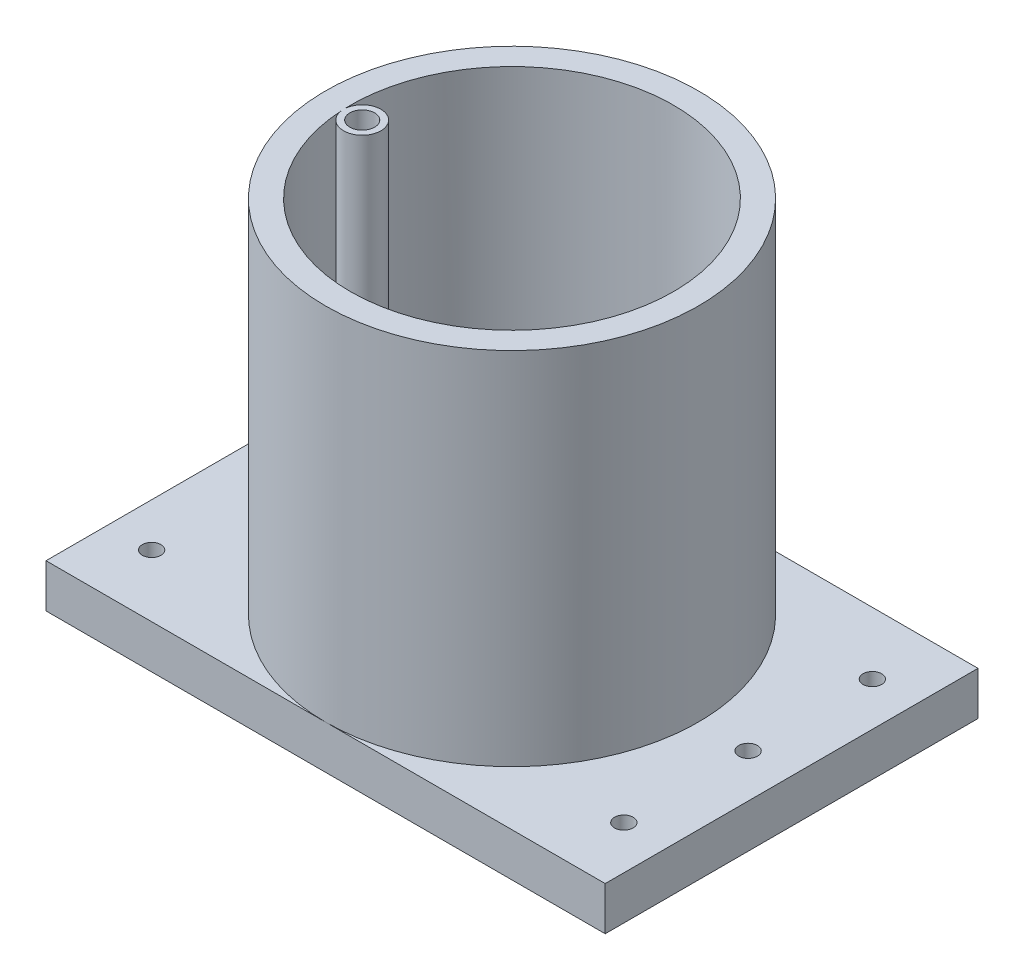
ISO-10303-21;
HEADER;
FILE_DESCRIPTION(('STEP AP214'),'2;1');
FILE_NAME('part.step','',(''),(''),'','','');
FILE_SCHEMA(('AUTOMOTIVE_DESIGN { 1 0 10303 214 1 1 1 1 }'));
ENDSEC;
DATA;
#1=APPLICATION_CONTEXT('core data for automotive mechanical design processes');
#2=APPLICATION_PROTOCOL_DEFINITION('international standard','automotive_design',2000,#1);
#3=PRODUCT_CONTEXT('',#1,'mechanical');
#4=PRODUCT('Part','Part','',(#3));
#5=PRODUCT_RELATED_PRODUCT_CATEGORY('part','',(#4));
#6=PRODUCT_DEFINITION_FORMATION('','',#4);
#7=PRODUCT_DEFINITION_CONTEXT('part definition',#1,'design');
#8=PRODUCT_DEFINITION('design','',#6,#7);
#9=PRODUCT_DEFINITION_SHAPE('','',#8);
#10=(LENGTH_UNIT() NAMED_UNIT(*) SI_UNIT(.MILLI.,.METRE.));
#11=(NAMED_UNIT(*) PLANE_ANGLE_UNIT() SI_UNIT($,.RADIAN.));
#12=(NAMED_UNIT(*) SI_UNIT($,.STERADIAN.) SOLID_ANGLE_UNIT());
#13=UNCERTAINTY_MEASURE_WITH_UNIT(LENGTH_MEASURE(1.E-05),#10,'distance_accuracy_value','');
#14=(GEOMETRIC_REPRESENTATION_CONTEXT(3) GLOBAL_UNCERTAINTY_ASSIGNED_CONTEXT((#13)) GLOBAL_UNIT_ASSIGNED_CONTEXT((#10,
#11,#12)) REPRESENTATION_CONTEXT('',''));
#15=CARTESIAN_POINT('',(0.,0.,0.));
#16=DIRECTION('',(0.,0.,1.));
#17=DIRECTION('',(1.,0.,0.));
#18=AXIS2_PLACEMENT_3D('',#15,#16,#17);
#19=CARTESIAN_POINT('',(0.,3.,0.));
#20=DIRECTION('',(0.,1.,0.));
#21=DIRECTION('',(0.,0.,1.));
#22=AXIS2_PLACEMENT_3D('',#19,#20,#21);
#23=CYLINDRICAL_SURFACE('',#22,26.);
#24=CARTESIAN_POINT('',(0.,7.,0.));
#25=DIRECTION('',(0.,1.,0.));
#26=DIRECTION('',(0.,0.,1.));
#27=AXIS2_PLACEMENT_3D('',#24,#25,#26);
#28=CIRCLE('',#27,26.);
#29=CARTESIAN_POINT('',(0.,7.,26.));
#30=VERTEX_POINT('',#29);
#31=EDGE_CURVE('E147',#30,#30,#28,.F.);
#32=ORIENTED_EDGE('',*,*,#31,.T.);
#33=EDGE_LOOP('',(#32));
#34=FACE_BOUND('',#33,.T.);
#35=DIRECTION('',(0.,-1.,0.));
#36=VECTOR('',#35,1.);
#37=CARTESIAN_POINT('',(-25.9609975449636,39.,1.42358929133108));
#38=LINE('',#37,#36);
#39=CARTESIAN_POINT('',(-25.9609975449636,65.,1.42358929133077));
#40=VERTEX_POINT('',#39);
#41=CARTESIAN_POINT('',(-25.9609975449636,13.,1.42358929133077));
#42=VERTEX_POINT('',#41);
#43=EDGE_CURVE('E190',#40,#42,#38,.T.);
#44=ORIENTED_EDGE('',*,*,#43,.F.);
#45=CARTESIAN_POINT('',(0.,65.,0.));
#46=DIRECTION('',(0.,1.,0.));
#47=DIRECTION('',(0.,0.,1.));
#48=AXIS2_PLACEMENT_3D('',#45,#46,#47);
#49=CIRCLE('',#48,26.);
#50=CARTESIAN_POINT('',(-25.9754601172315,65.,1.12936783118415));
#51=VERTEX_POINT('',#50);
#52=EDGE_CURVE('E175',#40,#51,#49,.T.);
#53=ORIENTED_EDGE('',*,*,#52,.T.);
#54=DIRECTION('',(0.,-1.,0.));
#55=VECTOR('',#54,1.);
#56=CARTESIAN_POINT('',(-25.9754601172315,39.,1.12936783118383));
#57=LINE('',#56,#55);
#58=CARTESIAN_POINT('',(-25.9754601172315,13.,1.12936783118415));
#59=VERTEX_POINT('',#58);
#60=EDGE_CURVE('E185',#59,#51,#57,.F.);
#61=ORIENTED_EDGE('',*,*,#60,.F.);
#62=CARTESIAN_POINT('',(-25.9609975449636,13.,1.42358929133075));
#63=DIRECTION('',(-0.0490961170696437,0.,-0.998794058496887));
#64=VECTOR('',#63,1.);
#65=LINE('',#62,#64);
#66=EDGE_CURVE('E71',#42,#59,#65,.T.);
#67=ORIENTED_EDGE('',*,*,#66,.F.);
#68=EDGE_LOOP('',(#44,#53,#61,#67));
#69=FACE_BOUND('',#68,.T.);
#70=ADVANCED_FACE('F45',(#34,#69),#23,.F.);
#71=CARTESIAN_POINT('',(0.,65.,0.));
#72=DIRECTION('',(0.,-1.,0.));
#73=DIRECTION('',(0.,0.,-1.));
#74=AXIS2_PLACEMENT_3D('',#71,#72,#73);
#75=CYLINDRICAL_SURFACE('',#74,30.);
#76=CARTESIAN_POINT('',(0.,7.,0.));
#77=DIRECTION('',(0.,1.,0.));
#78=DIRECTION('',(0.,0.,1.));
#79=AXIS2_PLACEMENT_3D('',#76,#77,#78);
#80=CIRCLE('',#79,30.);
#81=CARTESIAN_POINT('',(0.,7.,-30.));
#82=VERTEX_POINT('',#81);
#83=CARTESIAN_POINT('',(0.,7.,30.));
#84=VERTEX_POINT('',#83);
#85=EDGE_CURVE('E55',#82,#84,#80,.T.);
#86=ORIENTED_EDGE('',*,*,#85,.T.);
#87=EDGE_CURVE('E11',#84,#82,#80,.T.);
#88=ORIENTED_EDGE('',*,*,#87,.T.);
#89=EDGE_LOOP('',(#86,#88));
#90=FACE_BOUND('',#89,.T.);
#91=CARTESIAN_POINT('',(0.,65.,0.));
#92=DIRECTION('',(0.,1.,0.));
#93=DIRECTION('',(0.,0.,1.));
#94=AXIS2_PLACEMENT_3D('',#91,#92,#93);
#95=CIRCLE('',#94,30.);
#96=CARTESIAN_POINT('',(0.,65.,30.));
#97=VERTEX_POINT('',#96);
#98=EDGE_CURVE('E180',#97,#97,#95,.T.);
#99=ORIENTED_EDGE('',*,*,#98,.F.);
#100=EDGE_LOOP('',(#99));
#101=FACE_BOUND('',#100,.T.);
#102=ADVANCED_FACE('F47',(#90,#101),#75,.T.);
#103=CARTESIAN_POINT('',(0.,65.,0.));
#104=DIRECTION('',(0.,1.,0.));
#105=DIRECTION('',(0.,0.,1.));
#106=AXIS2_PLACEMENT_3D('',#103,#104,#105);
#107=PLANE('',#106);
#108=CARTESIAN_POINT('',(-22.9754601172315,65.,1.1293678311842));
#109=DIRECTION('',(0.,1.,0.));
#110=DIRECTION('',(0.,0.,1.));
#111=AXIS2_PLACEMENT_3D('',#108,#109,#110);
#112=CIRCLE('',#111,2.);
#113=CARTESIAN_POINT('',(-22.9754601172315,65.,3.1293678311842));
#114=VERTEX_POINT('',#113);
#115=EDGE_CURVE('E151',#114,#114,#112,.T.);
#116=ORIENTED_EDGE('',*,*,#115,.F.);
#117=EDGE_LOOP('',(#116));
#118=FACE_BOUND('',#117,.T.);
#119=ORIENTED_EDGE('',*,*,#52,.F.);
#120=CARTESIAN_POINT('',(-22.9754601172315,65.,1.1293678311842));
#121=DIRECTION('',(0.,1.,0.));
#122=DIRECTION('',(0.,0.,1.));
#123=AXIS2_PLACEMENT_3D('',#120,#121,#122);
#124=CIRCLE('',#123,3.);
#125=EDGE_CURVE('E168',#40,#51,#124,.T.);
#126=ORIENTED_EDGE('',*,*,#125,.T.);
#127=EDGE_LOOP('',(#119,#126));
#128=FACE_BOUND('',#127,.T.);
#129=ORIENTED_EDGE('',*,*,#98,.T.);
#130=EDGE_LOOP('',(#129));
#131=FACE_BOUND('',#130,.T.);
#132=ADVANCED_FACE('F257',(#118,#128,#131),#107,.T.);
#133=CARTESIAN_POINT('',(-22.9754601172315,65.,1.1293678311842));
#134=DIRECTION('',(0.,-1.,0.));
#135=DIRECTION('',(0.,0.,-1.));
#136=AXIS2_PLACEMENT_3D('',#133,#134,#135);
#137=CYLINDRICAL_SURFACE('',#136,3.);
#138=ORIENTED_EDGE('',*,*,#125,.F.);
#139=ORIENTED_EDGE('',*,*,#43,.T.);
#140=CARTESIAN_POINT('',(-22.9754601172315,13.,1.1293678311842));
#141=DIRECTION('',(0.,1.,0.));
#142=DIRECTION('',(0.,0.,1.));
#143=AXIS2_PLACEMENT_3D('',#140,#141,#142);
#144=CIRCLE('',#143,3.);
#145=EDGE_CURVE('E157',#42,#59,#144,.T.);
#146=ORIENTED_EDGE('',*,*,#145,.T.);
#147=ORIENTED_EDGE('',*,*,#60,.T.);
#148=EDGE_LOOP('',(#138,#139,#146,#147));
#149=FACE_BOUND('',#148,.T.);
#150=ADVANCED_FACE('F287',(#149),#137,.T.);
#151=CARTESIAN_POINT('',(-22.9754601172315,13.,1.1293678311842));
#152=DIRECTION('',(0.,1.,0.));
#153=DIRECTION('',(0.,0.,1.));
#154=AXIS2_PLACEMENT_3D('',#151,#152,#153);
#155=PLANE('',#154);
#156=CARTESIAN_POINT('',(-22.9754601172315,13.,1.1293678311842));
#157=DIRECTION('',(0.,1.,0.));
#158=DIRECTION('',(0.,0.,1.));
#159=AXIS2_PLACEMENT_3D('',#156,#157,#158);
#160=CIRCLE('',#159,2.);
#161=CARTESIAN_POINT('',(-22.9754601172315,13.,3.1293678311842));
#162=VERTEX_POINT('',#161);
#163=EDGE_CURVE('E153',#162,#162,#160,.T.);
#164=ORIENTED_EDGE('',*,*,#163,.T.);
#165=EDGE_LOOP('',(#164));
#166=FACE_BOUND('',#165,.T.);
#167=ORIENTED_EDGE('',*,*,#145,.F.);
#168=ORIENTED_EDGE('',*,*,#66,.T.);
#169=EDGE_LOOP('',(#167,#168));
#170=FACE_BOUND('',#169,.T.);
#171=ADVANCED_FACE('F333',(#166,#170),#155,.F.);
#172=CARTESIAN_POINT('',(-22.9754601172315,13.,1.1293678311842));
#173=DIRECTION('',(0.,1.,0.));
#174=DIRECTION('',(0.,0.,1.));
#175=AXIS2_PLACEMENT_3D('',#172,#173,#174);
#176=CYLINDRICAL_SURFACE('',#175,2.);
#177=ORIENTED_EDGE('',*,*,#163,.F.);
#178=EDGE_LOOP('',(#177));
#179=FACE_BOUND('',#178,.T.);
#180=ORIENTED_EDGE('',*,*,#115,.T.);
#181=EDGE_LOOP('',(#180));
#182=FACE_BOUND('',#181,.T.);
#183=ADVANCED_FACE('F322',(#179,#182),#176,.F.);
#184=CARTESIAN_POINT('',(0.,7.,0.));
#185=DIRECTION('',(0.,1.,0.));
#186=DIRECTION('',(0.,0.,1.));
#187=AXIS2_PLACEMENT_3D('',#184,#185,#186);
#188=PLANE('',#187);
#189=CARTESIAN_POINT('',(-38.,7.,20.));
#190=DIRECTION('',(0.,1.,0.));
#191=DIRECTION('',(0.,0.,1.));
#192=AXIS2_PLACEMENT_3D('',#189,#190,#191);
#193=CIRCLE('',#192,1.5);
#194=CARTESIAN_POINT('',(-38.,7.,21.5));
#195=VERTEX_POINT('',#194);
#196=EDGE_CURVE('E439',#195,#195,#193,.T.);
#197=ORIENTED_EDGE('',*,*,#196,.F.);
#198=EDGE_LOOP('',(#197));
#199=FACE_BOUND('',#198,.T.);
#200=CARTESIAN_POINT('',(-38.,7.,-20.));
#201=DIRECTION('',(0.,1.,0.));
#202=DIRECTION('',(0.,0.,1.));
#203=AXIS2_PLACEMENT_3D('',#200,#201,#202);
#204=CIRCLE('',#203,1.5);
#205=CARTESIAN_POINT('',(-38.,7.,-18.5));
#206=VERTEX_POINT('',#205);
#207=EDGE_CURVE('E206',#206,#206,#204,.T.);
#208=ORIENTED_EDGE('',*,*,#207,.F.);
#209=EDGE_LOOP('',(#208));
#210=FACE_BOUND('',#209,.T.);
#211=CARTESIAN_POINT('',(-38.,7.,0.));
#212=DIRECTION('',(0.,1.,0.));
#213=DIRECTION('',(0.,0.,1.));
#214=AXIS2_PLACEMENT_3D('',#211,#212,#213);
#215=CIRCLE('',#214,1.5);
#216=CARTESIAN_POINT('',(-38.,7.,1.5));
#217=VERTEX_POINT('',#216);
#218=EDGE_CURVE('E216',#217,#217,#215,.T.);
#219=ORIENTED_EDGE('',*,*,#218,.F.);
#220=EDGE_LOOP('',(#219));
#221=FACE_BOUND('',#220,.T.);
#222=ORIENTED_EDGE('',*,*,#85,.F.);
#223=DIRECTION('',(1.,0.,0.));
#224=VECTOR('',#223,1.);
#225=CARTESIAN_POINT('',(-45.,7.,-30.));
#226=LINE('',#225,#224);
#227=CARTESIAN_POINT('',(-45.,7.,-30.));
#228=VERTEX_POINT('',#227);
#229=EDGE_CURVE('E117',#228,#82,#226,.T.);
#230=ORIENTED_EDGE('',*,*,#229,.F.);
#231=DIRECTION('',(0.,0.,-1.));
#232=VECTOR('',#231,1.);
#233=CARTESIAN_POINT('',(-45.,7.,30.));
#234=LINE('',#233,#232);
#235=CARTESIAN_POINT('',(-45.,7.,30.));
#236=VERTEX_POINT('',#235);
#237=EDGE_CURVE('E137',#236,#228,#234,.T.);
#238=ORIENTED_EDGE('',*,*,#237,.F.);
#239=DIRECTION('',(1.,0.,0.));
#240=VECTOR('',#239,1.);
#241=CARTESIAN_POINT('',(-45.,7.,30.));
#242=LINE('',#241,#240);
#243=EDGE_CURVE('E63',#236,#84,#242,.T.);
#244=ORIENTED_EDGE('',*,*,#243,.T.);
#245=EDGE_LOOP('',(#222,#230,#238,#244));
#246=FACE_BOUND('',#245,.T.);
#247=ADVANCED_FACE('F253',(#199,#210,#221,#246),#188,.T.);
#248=CARTESIAN_POINT('',(45.,7.,30.));
#249=DIRECTION('',(-1.,0.,0.));
#250=DIRECTION('',(0.,0.,1.));
#251=AXIS2_PLACEMENT_3D('',#248,#249,#250);
#252=PLANE('',#251);
#253=DIRECTION('',(0.,0.,-1.));
#254=VECTOR('',#253,1.);
#255=CARTESIAN_POINT('',(45.,0.,30.));
#256=LINE('',#255,#254);
#257=CARTESIAN_POINT('',(45.,0.,30.));
#258=VERTEX_POINT('',#257);
#259=CARTESIAN_POINT('',(45.,0.,-30.));
#260=VERTEX_POINT('',#259);
#261=EDGE_CURVE('E134',#258,#260,#256,.T.);
#262=ORIENTED_EDGE('',*,*,#261,.T.);
#263=DIRECTION('',(0.,-1.,0.));
#264=VECTOR('',#263,1.);
#265=CARTESIAN_POINT('',(45.,7.,-30.));
#266=LINE('',#265,#264);
#267=CARTESIAN_POINT('',(45.,7.,-30.));
#268=VERTEX_POINT('',#267);
#269=EDGE_CURVE('E114',#268,#260,#266,.T.);
#270=ORIENTED_EDGE('',*,*,#269,.F.);
#271=DIRECTION('',(0.,0.,-1.));
#272=VECTOR('',#271,1.);
#273=CARTESIAN_POINT('',(45.,7.,30.));
#274=LINE('',#273,#272);
#275=CARTESIAN_POINT('',(45.,7.,30.));
#276=VERTEX_POINT('',#275);
#277=EDGE_CURVE('E124',#276,#268,#274,.T.);
#278=ORIENTED_EDGE('',*,*,#277,.F.);
#279=DIRECTION('',(0.,-1.,0.));
#280=VECTOR('',#279,1.);
#281=CARTESIAN_POINT('',(45.,7.,30.));
#282=LINE('',#281,#280);
#283=EDGE_CURVE('E136',#276,#258,#282,.T.);
#284=ORIENTED_EDGE('',*,*,#283,.T.);
#285=EDGE_LOOP('',(#262,#270,#278,#284));
#286=FACE_BOUND('',#285,.T.);
#287=ADVANCED_FACE('F132',(#286),#252,.F.);
#288=CARTESIAN_POINT('',(-45.,7.,30.));
#289=DIRECTION('',(-1.,0.,0.));
#290=DIRECTION('',(0.,0.,1.));
#291=AXIS2_PLACEMENT_3D('',#288,#289,#290);
#292=PLANE('',#291);
#293=DIRECTION('',(0.,0.,-1.));
#294=VECTOR('',#293,1.);
#295=CARTESIAN_POINT('',(-45.,0.,30.));
#296=LINE('',#295,#294);
#297=CARTESIAN_POINT('',(-45.,0.,30.));
#298=VERTEX_POINT('',#297);
#299=CARTESIAN_POINT('',(-45.,0.,-30.));
#300=VERTEX_POINT('',#299);
#301=EDGE_CURVE('E121',#298,#300,#296,.T.);
#302=ORIENTED_EDGE('',*,*,#301,.F.);
#303=DIRECTION('',(0.,-1.,0.));
#304=VECTOR('',#303,1.);
#305=CARTESIAN_POINT('',(-45.,7.,30.));
#306=LINE('',#305,#304);
#307=EDGE_CURVE('E141',#236,#298,#306,.T.);
#308=ORIENTED_EDGE('',*,*,#307,.F.);
#309=ORIENTED_EDGE('',*,*,#237,.T.);
#310=DIRECTION('',(0.,-1.,0.));
#311=VECTOR('',#310,1.);
#312=CARTESIAN_POINT('',(-45.,7.,-30.));
#313=LINE('',#312,#311);
#314=EDGE_CURVE('E152',#228,#300,#313,.T.);
#315=ORIENTED_EDGE('',*,*,#314,.T.);
#316=EDGE_LOOP('',(#302,#308,#309,#315));
#317=FACE_BOUND('',#316,.T.);
#318=ADVANCED_FACE('F250',(#317),#292,.T.);
#319=CARTESIAN_POINT('',(-45.,7.,30.));
#320=DIRECTION('',(0.,0.,-1.));
#321=DIRECTION('',(-1.,0.,0.));
#322=AXIS2_PLACEMENT_3D('',#319,#320,#321);
#323=PLANE('',#322);
#324=EDGE_CURVE('E126',#84,#276,#242,.T.);
#325=ORIENTED_EDGE('',*,*,#324,.F.);
#326=ORIENTED_EDGE('',*,*,#243,.F.);
#327=ORIENTED_EDGE('',*,*,#307,.T.);
#328=DIRECTION('',(1.,0.,0.));
#329=VECTOR('',#328,1.);
#330=CARTESIAN_POINT('',(-45.,0.,30.));
#331=LINE('',#330,#329);
#332=EDGE_CURVE('E236',#298,#258,#331,.T.);
#333=ORIENTED_EDGE('',*,*,#332,.T.);
#334=ORIENTED_EDGE('',*,*,#283,.F.);
#335=EDGE_LOOP('',(#325,#326,#327,#333,#334));
#336=FACE_BOUND('',#335,.T.);
#337=ADVANCED_FACE('F248',(#336),#323,.F.);
#338=CARTESIAN_POINT('',(-45.,7.,-30.));
#339=DIRECTION('',(0.,0.,-1.));
#340=DIRECTION('',(-1.,0.,0.));
#341=AXIS2_PLACEMENT_3D('',#338,#339,#340);
#342=PLANE('',#341);
#343=DIRECTION('',(1.,0.,0.));
#344=VECTOR('',#343,1.);
#345=CARTESIAN_POINT('',(-45.,0.,-30.));
#346=LINE('',#345,#344);
#347=EDGE_CURVE('E200',#300,#260,#346,.T.);
#348=ORIENTED_EDGE('',*,*,#347,.F.);
#349=ORIENTED_EDGE('',*,*,#314,.F.);
#350=ORIENTED_EDGE('',*,*,#229,.T.);
#351=EDGE_CURVE('E110',#82,#268,#226,.T.);
#352=ORIENTED_EDGE('',*,*,#351,.T.);
#353=ORIENTED_EDGE('',*,*,#269,.T.);
#354=EDGE_LOOP('',(#348,#349,#350,#352,#353));
#355=FACE_BOUND('',#354,.T.);
#356=ADVANCED_FACE('F112',(#355),#342,.T.);
#357=CARTESIAN_POINT('',(38.,7.,-20.));
#358=DIRECTION('',(0.,1.,0.));
#359=DIRECTION('',(0.,0.,1.));
#360=AXIS2_PLACEMENT_3D('',#357,#358,#359);
#361=CIRCLE('',#360,1.5);
#362=CARTESIAN_POINT('',(38.,7.,-18.5));
#363=VERTEX_POINT('',#362);
#364=EDGE_CURVE('E433',#363,#363,#361,.T.);
#365=ORIENTED_EDGE('',*,*,#364,.F.);
#366=EDGE_LOOP('',(#365));
#367=FACE_BOUND('',#366,.T.);
#368=CARTESIAN_POINT('',(38.,7.,20.));
#369=DIRECTION('',(0.,1.,0.));
#370=DIRECTION('',(0.,0.,1.));
#371=AXIS2_PLACEMENT_3D('',#368,#369,#370);
#372=CIRCLE('',#371,1.5);
#373=CARTESIAN_POINT('',(38.,7.,21.5));
#374=VERTEX_POINT('',#373);
#375=EDGE_CURVE('E435',#374,#374,#372,.T.);
#376=ORIENTED_EDGE('',*,*,#375,.F.);
#377=EDGE_LOOP('',(#376));
#378=FACE_BOUND('',#377,.T.);
#379=CARTESIAN_POINT('',(38.,7.,0.));
#380=DIRECTION('',(0.,1.,0.));
#381=DIRECTION('',(0.,0.,1.));
#382=AXIS2_PLACEMENT_3D('',#379,#380,#381);
#383=CIRCLE('',#382,1.5);
#384=CARTESIAN_POINT('',(38.,7.,1.5));
#385=VERTEX_POINT('',#384);
#386=EDGE_CURVE('E196',#385,#385,#383,.T.);
#387=ORIENTED_EDGE('',*,*,#386,.F.);
#388=EDGE_LOOP('',(#387));
#389=FACE_BOUND('',#388,.T.);
#390=ORIENTED_EDGE('',*,*,#87,.F.);
#391=ORIENTED_EDGE('',*,*,#324,.T.);
#392=ORIENTED_EDGE('',*,*,#277,.T.);
#393=ORIENTED_EDGE('',*,*,#351,.F.);
#394=EDGE_LOOP('',(#390,#391,#392,#393));
#395=FACE_BOUND('',#394,.T.);
#396=ADVANCED_FACE('F125',(#367,#378,#389,#395),#188,.T.);
#397=CARTESIAN_POINT('',(0.,0.,0.));
#398=DIRECTION('',(0.,1.,0.));
#399=DIRECTION('',(0.,0.,1.));
#400=AXIS2_PLACEMENT_3D('',#397,#398,#399);
#401=PLANE('',#400);
#402=CARTESIAN_POINT('',(38.,0.,-20.));
#403=DIRECTION('',(0.,1.,0.));
#404=DIRECTION('',(0.,0.,1.));
#405=AXIS2_PLACEMENT_3D('',#402,#403,#404);
#406=CIRCLE('',#405,1.5);
#407=CARTESIAN_POINT('',(38.,0.,-18.5));
#408=VERTEX_POINT('',#407);
#409=EDGE_CURVE('E49',#408,#408,#406,.T.);
#410=ORIENTED_EDGE('',*,*,#409,.T.);
#411=EDGE_LOOP('',(#410));
#412=FACE_BOUND('',#411,.T.);
#413=CARTESIAN_POINT('',(38.,0.,20.));
#414=DIRECTION('',(0.,1.,0.));
#415=DIRECTION('',(0.,0.,1.));
#416=AXIS2_PLACEMENT_3D('',#413,#414,#415);
#417=CIRCLE('',#416,1.5);
#418=CARTESIAN_POINT('',(38.,0.,21.5));
#419=VERTEX_POINT('',#418);
#420=EDGE_CURVE('E209',#419,#419,#417,.T.);
#421=ORIENTED_EDGE('',*,*,#420,.T.);
#422=EDGE_LOOP('',(#421));
#423=FACE_BOUND('',#422,.T.);
#424=CARTESIAN_POINT('',(-38.,0.,20.));
#425=DIRECTION('',(0.,1.,0.));
#426=DIRECTION('',(0.,0.,1.));
#427=AXIS2_PLACEMENT_3D('',#424,#425,#426);
#428=CIRCLE('',#427,1.5);
#429=CARTESIAN_POINT('',(-38.,0.,21.5));
#430=VERTEX_POINT('',#429);
#431=EDGE_CURVE('E205',#430,#430,#428,.T.);
#432=ORIENTED_EDGE('',*,*,#431,.T.);
#433=EDGE_LOOP('',(#432));
#434=FACE_BOUND('',#433,.T.);
#435=CARTESIAN_POINT('',(-38.,0.,-20.));
#436=DIRECTION('',(0.,1.,0.));
#437=DIRECTION('',(0.,0.,1.));
#438=AXIS2_PLACEMENT_3D('',#435,#436,#437);
#439=CIRCLE('',#438,1.5);
#440=CARTESIAN_POINT('',(-38.,0.,-18.5));
#441=VERTEX_POINT('',#440);
#442=EDGE_CURVE('E201',#441,#441,#439,.T.);
#443=ORIENTED_EDGE('',*,*,#442,.T.);
#444=EDGE_LOOP('',(#443));
#445=FACE_BOUND('',#444,.T.);
#446=CARTESIAN_POINT('',(38.,0.,0.));
#447=DIRECTION('',(0.,1.,0.));
#448=DIRECTION('',(0.,0.,1.));
#449=AXIS2_PLACEMENT_3D('',#446,#447,#448);
#450=CIRCLE('',#449,1.5);
#451=CARTESIAN_POINT('',(38.,0.,1.5));
#452=VERTEX_POINT('',#451);
#453=EDGE_CURVE('E195',#452,#452,#450,.T.);
#454=ORIENTED_EDGE('',*,*,#453,.T.);
#455=EDGE_LOOP('',(#454));
#456=FACE_BOUND('',#455,.T.);
#457=CARTESIAN_POINT('',(-38.,0.,0.));
#458=DIRECTION('',(0.,1.,0.));
#459=DIRECTION('',(0.,0.,1.));
#460=AXIS2_PLACEMENT_3D('',#457,#458,#459);
#461=CIRCLE('',#460,1.5);
#462=CARTESIAN_POINT('',(-38.,0.,1.5));
#463=VERTEX_POINT('',#462);
#464=EDGE_CURVE('E191',#463,#463,#461,.T.);
#465=ORIENTED_EDGE('',*,*,#464,.T.);
#466=EDGE_LOOP('',(#465));
#467=FACE_BOUND('',#466,.T.);
#468=ORIENTED_EDGE('',*,*,#301,.T.);
#469=ORIENTED_EDGE('',*,*,#347,.T.);
#470=ORIENTED_EDGE('',*,*,#261,.F.);
#471=ORIENTED_EDGE('',*,*,#332,.F.);
#472=EDGE_LOOP('',(#468,#469,#470,#471));
#473=FACE_BOUND('',#472,.T.);
#474=ADVANCED_FACE('F252',(#412,#423,#434,#445,#456,#467,#473),#401,.F.);
#475=ORIENTED_EDGE('',*,*,#31,.F.);
#476=EDGE_LOOP('',(#475));
#477=FACE_BOUND('',#476,.T.);
#478=ADVANCED_FACE('F291',(#477),#188,.T.);
#479=CARTESIAN_POINT('',(-38.,-3.,0.));
#480=DIRECTION('',(0.,1.,0.));
#481=DIRECTION('',(0.,0.,1.));
#482=AXIS2_PLACEMENT_3D('',#479,#480,#481);
#483=CYLINDRICAL_SURFACE('',#482,1.5);
#484=ORIENTED_EDGE('',*,*,#218,.T.);
#485=EDGE_LOOP('',(#484));
#486=FACE_BOUND('',#485,.T.);
#487=ORIENTED_EDGE('',*,*,#464,.F.);
#488=EDGE_LOOP('',(#487));
#489=FACE_BOUND('',#488,.T.);
#490=ADVANCED_FACE('F297',(#486,#489),#483,.F.);
#491=CARTESIAN_POINT('',(38.,-3.,0.));
#492=DIRECTION('',(0.,1.,0.));
#493=DIRECTION('',(0.,0.,1.));
#494=AXIS2_PLACEMENT_3D('',#491,#492,#493);
#495=CYLINDRICAL_SURFACE('',#494,1.5);
#496=ORIENTED_EDGE('',*,*,#386,.T.);
#497=EDGE_LOOP('',(#496));
#498=FACE_BOUND('',#497,.T.);
#499=ORIENTED_EDGE('',*,*,#453,.F.);
#500=EDGE_LOOP('',(#499));
#501=FACE_BOUND('',#500,.T.);
#502=ADVANCED_FACE('F311',(#498,#501),#495,.F.);
#503=CARTESIAN_POINT('',(-38.,-3.,-20.));
#504=DIRECTION('',(0.,1.,0.));
#505=DIRECTION('',(0.,0.,1.));
#506=AXIS2_PLACEMENT_3D('',#503,#504,#505);
#507=CYLINDRICAL_SURFACE('',#506,1.5);
#508=ORIENTED_EDGE('',*,*,#207,.T.);
#509=EDGE_LOOP('',(#508));
#510=FACE_BOUND('',#509,.T.);
#511=ORIENTED_EDGE('',*,*,#442,.F.);
#512=EDGE_LOOP('',(#511));
#513=FACE_BOUND('',#512,.T.);
#514=ADVANCED_FACE('F316',(#510,#513),#507,.F.);
#515=CARTESIAN_POINT('',(-38.,-3.,20.));
#516=DIRECTION('',(0.,1.,0.));
#517=DIRECTION('',(0.,0.,1.));
#518=AXIS2_PLACEMENT_3D('',#515,#516,#517);
#519=CYLINDRICAL_SURFACE('',#518,1.5);
#520=ORIENTED_EDGE('',*,*,#196,.T.);
#521=EDGE_LOOP('',(#520));
#522=FACE_BOUND('',#521,.T.);
#523=ORIENTED_EDGE('',*,*,#431,.F.);
#524=EDGE_LOOP('',(#523));
#525=FACE_BOUND('',#524,.T.);
#526=ADVANCED_FACE('F398',(#522,#525),#519,.F.);
#527=CARTESIAN_POINT('',(38.,-3.,20.));
#528=DIRECTION('',(0.,1.,0.));
#529=DIRECTION('',(0.,0.,1.));
#530=AXIS2_PLACEMENT_3D('',#527,#528,#529);
#531=CYLINDRICAL_SURFACE('',#530,1.5);
#532=ORIENTED_EDGE('',*,*,#375,.T.);
#533=EDGE_LOOP('',(#532));
#534=FACE_BOUND('',#533,.T.);
#535=ORIENTED_EDGE('',*,*,#420,.F.);
#536=EDGE_LOOP('',(#535));
#537=FACE_BOUND('',#536,.T.);
#538=ADVANCED_FACE('F407',(#534,#537),#531,.F.);
#539=CARTESIAN_POINT('',(38.,-3.,-20.));
#540=DIRECTION('',(0.,1.,0.));
#541=DIRECTION('',(0.,0.,1.));
#542=AXIS2_PLACEMENT_3D('',#539,#540,#541);
#543=CYLINDRICAL_SURFACE('',#542,1.5);
#544=ORIENTED_EDGE('',*,*,#364,.T.);
#545=EDGE_LOOP('',(#544));
#546=FACE_BOUND('',#545,.T.);
#547=ORIENTED_EDGE('',*,*,#409,.F.);
#548=EDGE_LOOP('',(#547));
#549=FACE_BOUND('',#548,.T.);
#550=ADVANCED_FACE('F417',(#546,#549),#543,.F.);
#551=CLOSED_SHELL('',(#70,#102,#132,#150,#171,#183,#247,#287,#318,#337,#356,#396,#474,#478,#490,
#502,#514,#526,#538,#550));
#552=MANIFOLD_SOLID_BREP('B2',#551);
#553=ADVANCED_BREP_SHAPE_REPRESENTATION('',(#18,#552),#14);
#554=SHAPE_DEFINITION_REPRESENTATION(#9,#553);
ENDSEC;
END-ISO-10303-21;
